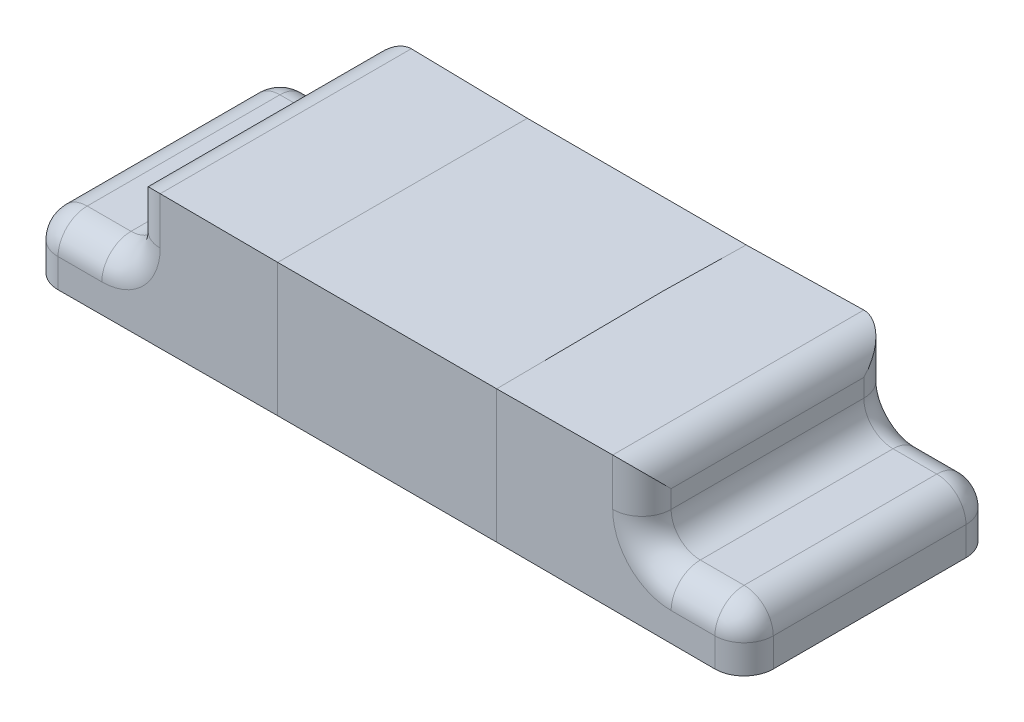
ISO-10303-21;
HEADER;
FILE_DESCRIPTION(('STEP AP214'),'2;1');
FILE_NAME('part.step','',(''),(''),'','','');
FILE_SCHEMA(('AUTOMOTIVE_DESIGN { 1 0 10303 214 1 1 1 1 }'));
ENDSEC;
DATA;
#1=APPLICATION_CONTEXT('core data for automotive mechanical design processes');
#2=APPLICATION_PROTOCOL_DEFINITION('international standard','automotive_design',2000,#1);
#3=PRODUCT_CONTEXT('',#1,'mechanical');
#4=PRODUCT('Part','Part','',(#3));
#5=PRODUCT_RELATED_PRODUCT_CATEGORY('part','',(#4));
#6=PRODUCT_DEFINITION_FORMATION('','',#4);
#7=PRODUCT_DEFINITION_CONTEXT('part definition',#1,'design');
#8=PRODUCT_DEFINITION('design','',#6,#7);
#9=PRODUCT_DEFINITION_SHAPE('','',#8);
#10=(LENGTH_UNIT() NAMED_UNIT(*) SI_UNIT(.MILLI.,.METRE.));
#11=(NAMED_UNIT(*) PLANE_ANGLE_UNIT() SI_UNIT($,.RADIAN.));
#12=(NAMED_UNIT(*) SI_UNIT($,.STERADIAN.) SOLID_ANGLE_UNIT());
#13=UNCERTAINTY_MEASURE_WITH_UNIT(LENGTH_MEASURE(1.E-05),#10,'distance_accuracy_value','');
#14=(GEOMETRIC_REPRESENTATION_CONTEXT(3) GLOBAL_UNCERTAINTY_ASSIGNED_CONTEXT((#13)) GLOBAL_UNIT_ASSIGNED_CONTEXT((#10,
#11,#12)) REPRESENTATION_CONTEXT('',''));
#15=CARTESIAN_POINT('',(0.,0.,0.));
#16=DIRECTION('',(0.,0.,1.));
#17=DIRECTION('',(1.,0.,0.));
#18=AXIS2_PLACEMENT_3D('',#15,#16,#17);
#19=CARTESIAN_POINT('',(0.875,0.,0.));
#20=DIRECTION('',(-1.,0.,0.));
#21=DIRECTION('',(0.,0.,1.));
#22=AXIS2_PLACEMENT_3D('',#19,#20,#21);
#23=PLANE('',#22);
#24=DIRECTION('',(0.,1.,0.));
#25=VECTOR('',#24,1.);
#26=CARTESIAN_POINT('',(0.875,0.,-0.33));
#27=LINE('',#26,#25);
#28=CARTESIAN_POINT('',(0.875,0.298442990090282,-0.33));
#29=VERTEX_POINT('',#28);
#30=CARTESIAN_POINT('',(0.875,0.36,-0.33));
#31=VERTEX_POINT('',#30);
#32=EDGE_CURVE('E511',#29,#31,#27,.T.);
#33=ORIENTED_EDGE('',*,*,#32,.T.);
#34=DIRECTION('',(0.,0.,1.));
#35=VECTOR('',#34,1.);
#36=CARTESIAN_POINT('',(0.875,0.36,0.));
#37=LINE('',#36,#35);
#38=CARTESIAN_POINT('',(0.875,0.36,0.33));
#39=VERTEX_POINT('',#38);
#40=EDGE_CURVE('E486',#31,#39,#37,.T.);
#41=ORIENTED_EDGE('',*,*,#40,.T.);
#42=DIRECTION('',(0.,-1.,0.));
#43=VECTOR('',#42,1.);
#44=CARTESIAN_POINT('',(0.875,0.,0.33));
#45=LINE('',#44,#43);
#46=CARTESIAN_POINT('',(0.875,0.298442990090282,0.33));
#47=VERTEX_POINT('',#46);
#48=EDGE_CURVE('E514',#39,#47,#45,.T.);
#49=ORIENTED_EDGE('',*,*,#48,.T.);
#50=DIRECTION('',(0.,0.,1.));
#51=VECTOR('',#50,1.);
#52=CARTESIAN_POINT('',(0.875,0.298442990090282,-0.43));
#53=LINE('',#52,#51);
#54=EDGE_CURVE('E276',#47,#29,#53,.F.);
#55=ORIENTED_EDGE('',*,*,#54,.T.);
#56=EDGE_LOOP('',(#33,#41,#49,#55));
#57=FACE_BOUND('',#56,.T.);
#58=ADVANCED_FACE('F43',(#57),#23,.F.);
#59=CARTESIAN_POINT('',(0.375,0.,-0.425));
#60=DIRECTION('',(0.,0.,1.));
#61=DIRECTION('',(1.,0.,0.));
#62=AXIS2_PLACEMENT_3D('',#59,#60,#61);
#63=PLANE('',#62);
#64=CARTESIAN_POINT('',(-0.375,0.,-0.425));
#65=DIRECTION('',(0.,1.,0.));
#66=VECTOR('',#65,1.);
#67=LINE('',#64,#66);
#68=CARTESIAN_POINT('',(-0.375,0.,-0.4275));
#69=VERTEX_POINT('',#68);
#70=CARTESIAN_POINT('',(-0.375,0.455,-0.4275));
#71=VERTEX_POINT('',#70);
#72=EDGE_CURVE('E236',#69,#71,#67,.T.);
#73=ORIENTED_EDGE('',*,*,#72,.T.);
#74=DIRECTION('',(-1.,0.,0.));
#75=VECTOR('',#74,1.);
#76=CARTESIAN_POINT('',(0.375,0.45,-0.425));
#77=LINE('',#76,#75);
#78=CARTESIAN_POINT('',(0.375,0.454472135955,-0.4272360679775));
#79=VERTEX_POINT('',#78);
#80=EDGE_CURVE('E273',#79,#71,#77,.T.);
#81=ORIENTED_EDGE('',*,*,#80,.F.);
#82=CARTESIAN_POINT('',(0.375,0.,-0.43));
#83=DIRECTION('',(0.,1.,0.));
#84=VECTOR('',#83,1.);
#85=LINE('',#82,#84);
#86=CARTESIAN_POINT('',(0.375,0.,-0.4275));
#87=VERTEX_POINT('',#86);
#88=EDGE_CURVE('E252',#87,#79,#85,.T.);
#89=ORIENTED_EDGE('',*,*,#88,.F.);
#90=DIRECTION('',(-1.,0.,0.));
#91=VECTOR('',#90,1.);
#92=CARTESIAN_POINT('',(0.375,0.,-0.425));
#93=LINE('',#92,#91);
#94=EDGE_CURVE('E225',#87,#69,#93,.T.);
#95=ORIENTED_EDGE('',*,*,#94,.T.);
#96=EDGE_LOOP('',(#73,#81,#89,#95));
#97=FACE_BOUND('',#96,.T.);
#98=ADVANCED_FACE('F250',(#97),#63,.F.);
#99=CARTESIAN_POINT('',(0.375,0.45,0.425));
#100=DIRECTION('',(0.,-1.,0.));
#101=DIRECTION('',(0.,0.,-1.));
#102=AXIS2_PLACEMENT_3D('',#99,#100,#101);
#103=PLANE('',#102);
#104=CARTESIAN_POINT('',(-0.375,0.45,-0.425));
#105=DIRECTION('',(0.,0.,1.));
#106=VECTOR('',#105,1.);
#107=LINE('',#104,#106);
#108=CARTESIAN_POINT('',(-0.375,0.455,0.4275));
#109=VERTEX_POINT('',#108);
#110=EDGE_CURVE('E246',#71,#109,#107,.T.);
#111=ORIENTED_EDGE('',*,*,#110,.T.);
#112=DIRECTION('',(-1.,0.,0.));
#113=VECTOR('',#112,1.);
#114=CARTESIAN_POINT('',(0.375,0.45,0.425));
#115=LINE('',#114,#113);
#116=CARTESIAN_POINT('',(0.375,0.455,0.4275));
#117=VERTEX_POINT('',#116);
#118=EDGE_CURVE('E258',#117,#109,#115,.T.);
#119=ORIENTED_EDGE('',*,*,#118,.F.);
#120=DIRECTION('',(0.,0.,1.));
#121=VECTOR('',#120,1.);
#122=CARTESIAN_POINT('',(0.375,0.45,0.425));
#123=LINE('',#122,#121);
#124=EDGE_CURVE('E261',#79,#117,#123,.T.);
#125=ORIENTED_EDGE('',*,*,#124,.F.);
#126=ORIENTED_EDGE('',*,*,#80,.T.);
#127=EDGE_LOOP('',(#111,#119,#125,#126));
#128=FACE_BOUND('',#127,.T.);
#129=ADVANCED_FACE('F300',(#128),#103,.F.);
#130=CARTESIAN_POINT('',(0.375,0.,0.425));
#131=DIRECTION('',(0.,0.,-1.));
#132=DIRECTION('',(-1.,0.,0.));
#133=AXIS2_PLACEMENT_3D('',#130,#131,#132);
#134=PLANE('',#133);
#135=CARTESIAN_POINT('',(-0.375,0.45,0.425));
#136=DIRECTION('',(0.,-1.,0.));
#137=VECTOR('',#136,1.);
#138=LINE('',#135,#137);
#139=CARTESIAN_POINT('',(-0.375,0.,0.4275));
#140=VERTEX_POINT('',#139);
#141=EDGE_CURVE('E341',#109,#140,#138,.T.);
#142=ORIENTED_EDGE('',*,*,#141,.T.);
#143=DIRECTION('',(-1.,0.,0.));
#144=VECTOR('',#143,1.);
#145=CARTESIAN_POINT('',(0.375,0.,0.425));
#146=LINE('',#145,#144);
#147=CARTESIAN_POINT('',(0.375,0.,0.4275));
#148=VERTEX_POINT('',#147);
#149=EDGE_CURVE('E254',#148,#140,#146,.T.);
#150=ORIENTED_EDGE('',*,*,#149,.F.);
#151=CARTESIAN_POINT('',(0.375,0.46,0.43));
#152=DIRECTION('',(0.,-1.,0.));
#153=VECTOR('',#152,1.);
#154=LINE('',#151,#153);
#155=EDGE_CURVE('E255',#117,#148,#154,.T.);
#156=ORIENTED_EDGE('',*,*,#155,.F.);
#157=ORIENTED_EDGE('',*,*,#118,.T.);
#158=EDGE_LOOP('',(#142,#150,#156,#157));
#159=FACE_BOUND('',#158,.T.);
#160=ADVANCED_FACE('F290',(#159),#134,.F.);
#161=CARTESIAN_POINT('',(0.375,0.,0.425));
#162=DIRECTION('',(0.,1.,0.));
#163=DIRECTION('',(0.,0.,1.));
#164=AXIS2_PLACEMENT_3D('',#161,#162,#163);
#165=PLANE('',#164);
#166=DIRECTION('',(0.,0.,-1.));
#167=VECTOR('',#166,1.);
#168=CARTESIAN_POINT('',(-1.225,0.,0.43));
#169=LINE('',#168,#167);
#170=CARTESIAN_POINT('',(-1.225,0.,0.33));
#171=VERTEX_POINT('',#170);
#172=CARTESIAN_POINT('',(-1.225,0.,-0.33));
#173=VERTEX_POINT('',#172);
#174=EDGE_CURVE('E330',#171,#173,#169,.T.);
#175=ORIENTED_EDGE('',*,*,#174,.T.);
#176=CARTESIAN_POINT('',(-1.125,0.,-0.33));
#177=DIRECTION('',(0.,1.,0.));
#178=DIRECTION('',(0.,0.,1.));
#179=AXIS2_PLACEMENT_3D('',#176,#177,#178);
#180=CIRCLE('',#179,0.1);
#181=CARTESIAN_POINT('',(-1.125,0.,-0.43));
#182=VERTEX_POINT('',#181);
#183=EDGE_CURVE('E228',#173,#182,#180,.F.);
#184=ORIENTED_EDGE('',*,*,#183,.T.);
#185=DIRECTION('',(1.,0.,0.));
#186=VECTOR('',#185,1.);
#187=CARTESIAN_POINT('',(-0.875,0.,-0.43));
#188=LINE('',#187,#186);
#189=EDGE_CURVE('E219',#182,#69,#188,.T.);
#190=ORIENTED_EDGE('',*,*,#189,.T.);
#191=ORIENTED_EDGE('',*,*,#94,.F.);
#192=DIRECTION('',(-1.,0.,0.));
#193=VECTOR('',#192,1.);
#194=CARTESIAN_POINT('',(0.875,0.,-0.43));
#195=LINE('',#194,#193);
#196=CARTESIAN_POINT('',(1.125,0.,-0.43));
#197=VERTEX_POINT('',#196);
#198=EDGE_CURVE('E468',#197,#87,#195,.T.);
#199=ORIENTED_EDGE('',*,*,#198,.F.);
#200=CARTESIAN_POINT('',(1.125,0.,-0.33));
#201=DIRECTION('',(0.,1.,0.));
#202=DIRECTION('',(0.,0.,1.));
#203=AXIS2_PLACEMENT_3D('',#200,#201,#202);
#204=CIRCLE('',#203,0.1);
#205=CARTESIAN_POINT('',(1.225,0.,-0.33));
#206=VERTEX_POINT('',#205);
#207=EDGE_CURVE('E666',#197,#206,#204,.F.);
#208=ORIENTED_EDGE('',*,*,#207,.T.);
#209=DIRECTION('',(0.,0.,-1.));
#210=VECTOR('',#209,1.);
#211=CARTESIAN_POINT('',(1.225,0.,0.43));
#212=LINE('',#211,#210);
#213=CARTESIAN_POINT('',(1.225,0.,0.33));
#214=VERTEX_POINT('',#213);
#215=EDGE_CURVE('E461',#214,#206,#212,.T.);
#216=ORIENTED_EDGE('',*,*,#215,.F.);
#217=CARTESIAN_POINT('',(1.125,0.,0.33));
#218=DIRECTION('',(0.,1.,0.));
#219=DIRECTION('',(0.,0.,1.));
#220=AXIS2_PLACEMENT_3D('',#217,#218,#219);
#221=CIRCLE('',#220,0.1);
#222=CARTESIAN_POINT('',(1.125,0.,0.43));
#223=VERTEX_POINT('',#222);
#224=EDGE_CURVE('E662',#214,#223,#221,.F.);
#225=ORIENTED_EDGE('',*,*,#224,.T.);
#226=DIRECTION('',(-1.,0.,0.));
#227=VECTOR('',#226,1.);
#228=CARTESIAN_POINT('',(0.875,0.,0.43));
#229=LINE('',#228,#227);
#230=EDGE_CURVE('E412',#223,#148,#229,.T.);
#231=ORIENTED_EDGE('',*,*,#230,.T.);
#232=ORIENTED_EDGE('',*,*,#149,.T.);
#233=DIRECTION('',(1.,0.,0.));
#234=VECTOR('',#233,1.);
#235=CARTESIAN_POINT('',(-0.875,0.,0.43));
#236=LINE('',#235,#234);
#237=CARTESIAN_POINT('',(-1.125,0.,0.43));
#238=VERTEX_POINT('',#237);
#239=EDGE_CURVE('E233',#238,#140,#236,.T.);
#240=ORIENTED_EDGE('',*,*,#239,.F.);
#241=CARTESIAN_POINT('',(-1.125,0.,0.33));
#242=DIRECTION('',(0.,1.,0.));
#243=DIRECTION('',(0.,0.,1.));
#244=AXIS2_PLACEMENT_3D('',#241,#242,#243);
#245=CIRCLE('',#244,0.1);
#246=EDGE_CURVE('E66',#238,#171,#245,.F.);
#247=ORIENTED_EDGE('',*,*,#246,.T.);
#248=EDGE_LOOP('',(#175,#184,#190,#191,#199,#208,#216,#225,#231,#232,#240,#247));
#249=FACE_BOUND('',#248,.T.);
#250=ADVANCED_FACE('F222',(#249),#165,.F.);
#251=CARTESIAN_POINT('',(0.875,0.,-0.43));
#252=DIRECTION('',(0.,0.,1.));
#253=DIRECTION('',(1.,0.,0.));
#254=AXIS2_PLACEMENT_3D('',#251,#252,#253);
#255=PLANE('',#254);
#256=DIRECTION('',(-1.,0.,0.));
#257=VECTOR('',#256,1.);
#258=CARTESIAN_POINT('',(0.875,0.098442990090282,-0.43));
#259=LINE('',#258,#257);
#260=CARTESIAN_POINT('',(0.975,0.098442990090282,-0.43));
#261=VERTEX_POINT('',#260);
#262=CARTESIAN_POINT('',(1.125,0.098442990090282,-0.43));
#263=VERTEX_POINT('',#262);
#264=EDGE_CURVE('E488',#261,#263,#259,.F.);
#265=ORIENTED_EDGE('',*,*,#264,.T.);
#266=DIRECTION('',(0.,1.,0.));
#267=VECTOR('',#266,1.);
#268=CARTESIAN_POINT('',(1.125,0.,-0.43));
#269=LINE('',#268,#267);
#270=EDGE_CURVE('E467',#263,#197,#269,.F.);
#271=ORIENTED_EDGE('',*,*,#270,.T.);
#272=ORIENTED_EDGE('',*,*,#198,.T.);
#273=ORIENTED_EDGE('',*,*,#88,.T.);
#274=DIRECTION('',(-1.,0.,0.));
#275=VECTOR('',#274,1.);
#276=CARTESIAN_POINT('',(0.875,0.46,-0.43));
#277=LINE('',#276,#275);
#278=CARTESIAN_POINT('',(0.775,0.46,-0.43));
#279=VERTEX_POINT('',#278);
#280=EDGE_CURVE('E247',#279,#79,#277,.T.);
#281=ORIENTED_EDGE('',*,*,#280,.F.);
#282=DIRECTION('',(0.,1.,0.));
#283=VECTOR('',#282,1.);
#284=CARTESIAN_POINT('',(0.775,0.,-0.43));
#285=LINE('',#284,#283);
#286=CARTESIAN_POINT('',(0.775,0.298442990090282,-0.43));
#287=VERTEX_POINT('',#286);
#288=EDGE_CURVE('E413',#279,#287,#285,.F.);
#289=ORIENTED_EDGE('',*,*,#288,.T.);
#290=CARTESIAN_POINT('',(0.975,0.298442990090282,-0.43));
#291=DIRECTION('',(0.,0.,1.));
#292=DIRECTION('',(1.,0.,0.));
#293=AXIS2_PLACEMENT_3D('',#290,#291,#292);
#294=CIRCLE('',#293,0.2);
#295=EDGE_CURVE('E490',#261,#287,#294,.F.);
#296=ORIENTED_EDGE('',*,*,#295,.F.);
#297=EDGE_LOOP('',(#265,#271,#272,#273,#281,#289,#296));
#298=FACE_BOUND('',#297,.T.);
#299=ADVANCED_FACE('F498',(#298),#255,.F.);
#300=CARTESIAN_POINT('',(0.875,0.46,0.43));
#301=DIRECTION('',(0.,-1.,0.));
#302=DIRECTION('',(0.,0.,-1.));
#303=AXIS2_PLACEMENT_3D('',#300,#301,#302);
#304=PLANE('',#303);
#305=DIRECTION('',(-1.,0.,0.));
#306=VECTOR('',#305,1.);
#307=CARTESIAN_POINT('',(0.875,0.46,0.43));
#308=LINE('',#307,#306);
#309=CARTESIAN_POINT('',(0.775,0.46,0.43));
#310=VERTEX_POINT('',#309);
#311=EDGE_CURVE('E409',#310,#117,#308,.T.);
#312=ORIENTED_EDGE('',*,*,#311,.F.);
#313=DIRECTION('',(0.,0.,1.));
#314=VECTOR('',#313,1.);
#315=CARTESIAN_POINT('',(0.775,0.46,0.43));
#316=LINE('',#315,#314);
#317=EDGE_CURVE('E422',#310,#279,#316,.F.);
#318=ORIENTED_EDGE('',*,*,#317,.T.);
#319=ORIENTED_EDGE('',*,*,#280,.T.);
#320=DIRECTION('',(0.,0.,1.));
#321=VECTOR('',#320,1.);
#322=CARTESIAN_POINT('',(0.375,0.46,0.43));
#323=LINE('',#322,#321);
#324=EDGE_CURVE('E471',#79,#117,#323,.T.);
#325=ORIENTED_EDGE('',*,*,#324,.T.);
#326=EDGE_LOOP('',(#312,#318,#319,#325));
#327=FACE_BOUND('',#326,.T.);
#328=ADVANCED_FACE('F392',(#327),#304,.F.);
#329=CARTESIAN_POINT('',(0.875,0.,0.43));
#330=DIRECTION('',(0.,0.,-1.));
#331=DIRECTION('',(-1.,0.,0.));
#332=AXIS2_PLACEMENT_3D('',#329,#330,#331);
#333=PLANE('',#332);
#334=ORIENTED_EDGE('',*,*,#230,.F.);
#335=DIRECTION('',(0.,-1.,0.));
#336=VECTOR('',#335,1.);
#337=CARTESIAN_POINT('',(1.125,0.,0.43));
#338=LINE('',#337,#336);
#339=CARTESIAN_POINT('',(1.125,0.098442990090282,0.43));
#340=VERTEX_POINT('',#339);
#341=EDGE_CURVE('E668',#223,#340,#338,.F.);
#342=ORIENTED_EDGE('',*,*,#341,.T.);
#343=DIRECTION('',(-1.,0.,0.));
#344=VECTOR('',#343,1.);
#345=CARTESIAN_POINT('',(0.875,0.098442990090282,0.43));
#346=LINE('',#345,#344);
#347=CARTESIAN_POINT('',(0.975,0.098442990090282,0.43));
#348=VERTEX_POINT('',#347);
#349=EDGE_CURVE('E418',#340,#348,#346,.T.);
#350=ORIENTED_EDGE('',*,*,#349,.T.);
#351=CARTESIAN_POINT('',(0.975,0.298442990090282,0.43));
#352=DIRECTION('',(0.,0.,-1.));
#353=DIRECTION('',(-1.,0.,0.));
#354=AXIS2_PLACEMENT_3D('',#351,#352,#353);
#355=CIRCLE('',#354,0.2);
#356=CARTESIAN_POINT('',(0.775,0.298442990090282,0.43));
#357=VERTEX_POINT('',#356);
#358=EDGE_CURVE('E415',#357,#348,#355,.F.);
#359=ORIENTED_EDGE('',*,*,#358,.F.);
#360=DIRECTION('',(0.,-1.,0.));
#361=VECTOR('',#360,1.);
#362=CARTESIAN_POINT('',(0.775,0.,0.43));
#363=LINE('',#362,#361);
#364=EDGE_CURVE('E420',#357,#310,#363,.F.);
#365=ORIENTED_EDGE('',*,*,#364,.T.);
#366=ORIENTED_EDGE('',*,*,#311,.T.);
#367=ORIENTED_EDGE('',*,*,#155,.T.);
#368=EDGE_LOOP('',(#334,#342,#350,#359,#365,#366,#367));
#369=FACE_BOUND('',#368,.T.);
#370=ADVANCED_FACE('F387',(#369),#333,.F.);
#371=CARTESIAN_POINT('',(0.375,0.,0.));
#372=DIRECTION('',(-1.,0.,0.));
#373=DIRECTION('',(0.,0.,1.));
#374=AXIS2_PLACEMENT_3D('',#371,#372,#373);
#375=PLANE('',#374);
#376=ORIENTED_EDGE('',*,*,#324,.F.);
#377=ORIENTED_EDGE('',*,*,#124,.T.);
#378=EDGE_LOOP('',(#376,#377));
#379=FACE_BOUND('',#378,.T.);
#380=ADVANCED_FACE('F380',(#379),#375,.T.);
#381=CARTESIAN_POINT('',(1.225,0.198442990090282,0.43));
#382=DIRECTION('',(0.,-1.,0.));
#383=DIRECTION('',(0.,0.,-1.));
#384=AXIS2_PLACEMENT_3D('',#381,#382,#383);
#385=PLANE('',#384);
#386=DIRECTION('',(-1.,0.,0.));
#387=VECTOR('',#386,1.);
#388=CARTESIAN_POINT('',(1.225,0.198442990090282,-0.33));
#389=LINE('',#388,#387);
#390=CARTESIAN_POINT('',(1.125,0.198442990090282,-0.33));
#391=VERTEX_POINT('',#390);
#392=CARTESIAN_POINT('',(0.975,0.198442990090282,-0.33));
#393=VERTEX_POINT('',#392);
#394=EDGE_CURVE('E430',#391,#393,#389,.T.);
#395=ORIENTED_EDGE('',*,*,#394,.T.);
#396=DIRECTION('',(0.,0.,1.));
#397=VECTOR('',#396,1.);
#398=CARTESIAN_POINT('',(0.975,0.198442990090282,0.43));
#399=LINE('',#398,#397);
#400=CARTESIAN_POINT('',(0.975,0.198442990090282,0.33));
#401=VERTEX_POINT('',#400);
#402=EDGE_CURVE('E433',#393,#401,#399,.T.);
#403=ORIENTED_EDGE('',*,*,#402,.T.);
#404=DIRECTION('',(-1.,0.,0.));
#405=VECTOR('',#404,1.);
#406=CARTESIAN_POINT('',(1.225,0.198442990090282,0.33));
#407=LINE('',#406,#405);
#408=CARTESIAN_POINT('',(1.125,0.198442990090282,0.33));
#409=VERTEX_POINT('',#408);
#410=EDGE_CURVE('E427',#401,#409,#407,.F.);
#411=ORIENTED_EDGE('',*,*,#410,.T.);
#412=DIRECTION('',(0.,0.,1.));
#413=VECTOR('',#412,1.);
#414=CARTESIAN_POINT('',(1.125,0.198442990090282,0.43));
#415=LINE('',#414,#413);
#416=EDGE_CURVE('E424',#409,#391,#415,.F.);
#417=ORIENTED_EDGE('',*,*,#416,.T.);
#418=EDGE_LOOP('',(#395,#403,#411,#417));
#419=FACE_BOUND('',#418,.T.);
#420=ADVANCED_FACE('F376',(#419),#385,.F.);
#421=CARTESIAN_POINT('',(1.225,0.,0.));
#422=DIRECTION('',(-1.,0.,0.));
#423=DIRECTION('',(0.,0.,1.));
#424=AXIS2_PLACEMENT_3D('',#421,#422,#423);
#425=PLANE('',#424);
#426=ORIENTED_EDGE('',*,*,#215,.T.);
#427=DIRECTION('',(0.,1.,0.));
#428=VECTOR('',#427,1.);
#429=CARTESIAN_POINT('',(1.225,0.,-0.33));
#430=LINE('',#429,#428);
#431=CARTESIAN_POINT('',(1.225,0.098442990090282,-0.33));
#432=VERTEX_POINT('',#431);
#433=EDGE_CURVE('E464',#206,#432,#430,.T.);
#434=ORIENTED_EDGE('',*,*,#433,.T.);
#435=DIRECTION('',(0.,0.,1.));
#436=VECTOR('',#435,1.);
#437=CARTESIAN_POINT('',(1.225,0.098442990090282,0.));
#438=LINE('',#437,#436);
#439=CARTESIAN_POINT('',(1.225,0.098442990090282,0.33));
#440=VERTEX_POINT('',#439);
#441=EDGE_CURVE('E435',#432,#440,#438,.T.);
#442=ORIENTED_EDGE('',*,*,#441,.T.);
#443=DIRECTION('',(0.,-1.,0.));
#444=VECTOR('',#443,1.);
#445=CARTESIAN_POINT('',(1.225,0.,0.33));
#446=LINE('',#445,#444);
#447=EDGE_CURVE('E438',#440,#214,#446,.T.);
#448=ORIENTED_EDGE('',*,*,#447,.T.);
#449=EDGE_LOOP('',(#426,#434,#442,#448));
#450=FACE_BOUND('',#449,.T.);
#451=ADVANCED_FACE('F365',(#450),#425,.F.);
#452=CARTESIAN_POINT('',(0.875,0.098442990090282,0.33));
#453=DIRECTION('',(-1.,0.,0.));
#454=DIRECTION('',(0.,0.,1.));
#455=AXIS2_PLACEMENT_3D('',#452,#453,#454);
#456=CYLINDRICAL_SURFACE('',#455,0.1);
#457=ORIENTED_EDGE('',*,*,#349,.F.);
#458=CARTESIAN_POINT('',(1.125,0.098442990090282,0.33));
#459=DIRECTION('',(-1.,0.,0.));
#460=DIRECTION('',(0.,0.,1.));
#461=AXIS2_PLACEMENT_3D('',#458,#459,#460);
#462=CIRCLE('',#461,0.1);
#463=EDGE_CURVE('E676',#340,#409,#462,.T.);
#464=ORIENTED_EDGE('',*,*,#463,.T.);
#465=ORIENTED_EDGE('',*,*,#410,.F.);
#466=CARTESIAN_POINT('',(0.975,0.098442990090282,0.33));
#467=DIRECTION('',(-1.,0.,0.));
#468=DIRECTION('',(0.,0.,1.));
#469=AXIS2_PLACEMENT_3D('',#466,#467,#468);
#470=CIRCLE('',#469,0.1);
#471=EDGE_CURVE('E458',#348,#401,#470,.T.);
#472=ORIENTED_EDGE('',*,*,#471,.F.);
#473=EDGE_LOOP('',(#457,#464,#465,#472));
#474=FACE_BOUND('',#473,.T.);
#475=ADVANCED_FACE('F375',(#474),#456,.T.);
#476=CARTESIAN_POINT('',(1.125,0.098442990090282,0.));
#477=DIRECTION('',(0.,0.,1.));
#478=DIRECTION('',(1.,0.,0.));
#479=AXIS2_PLACEMENT_3D('',#476,#477,#478);
#480=CYLINDRICAL_SURFACE('',#479,0.1);
#481=ORIENTED_EDGE('',*,*,#441,.F.);
#482=CARTESIAN_POINT('',(1.125,0.098442990090282,-0.33));
#483=DIRECTION('',(0.,0.,1.));
#484=DIRECTION('',(1.,0.,0.));
#485=AXIS2_PLACEMENT_3D('',#482,#483,#484);
#486=CIRCLE('',#485,0.1);
#487=EDGE_CURVE('E674',#432,#391,#486,.T.);
#488=ORIENTED_EDGE('',*,*,#487,.T.);
#489=ORIENTED_EDGE('',*,*,#416,.F.);
#490=CARTESIAN_POINT('',(1.125,0.098442990090282,0.33));
#491=DIRECTION('',(0.,0.,1.));
#492=DIRECTION('',(1.,0.,0.));
#493=AXIS2_PLACEMENT_3D('',#490,#491,#492);
#494=CIRCLE('',#493,0.1);
#495=EDGE_CURVE('E672',#409,#440,#494,.F.);
#496=ORIENTED_EDGE('',*,*,#495,.T.);
#497=EDGE_LOOP('',(#481,#488,#489,#496));
#498=FACE_BOUND('',#497,.T.);
#499=ADVANCED_FACE('F551',(#498),#480,.T.);
#500=CARTESIAN_POINT('',(0.975,0.298442990090282,0.33));
#501=DIRECTION('',(0.,0.,-1.));
#502=DIRECTION('',(-1.,0.,0.));
#503=AXIS2_PLACEMENT_3D('',#500,#501,#502);
#504=TOROIDAL_SURFACE('',#503,0.2,0.1);
#505=ORIENTED_EDGE('',*,*,#358,.T.);
#506=ORIENTED_EDGE('',*,*,#471,.T.);
#507=CARTESIAN_POINT('',(0.975,0.298442990090282,0.33));
#508=DIRECTION('',(0.,0.,-1.));
#509=DIRECTION('',(-1.,0.,0.));
#510=AXIS2_PLACEMENT_3D('',#507,#508,#509);
#511=CIRCLE('',#510,0.1);
#512=EDGE_CURVE('E455',#47,#401,#511,.F.);
#513=ORIENTED_EDGE('',*,*,#512,.F.);
#514=CARTESIAN_POINT('',(0.775,0.298442990090282,0.33));
#515=DIRECTION('',(0.,-1.,0.));
#516=DIRECTION('',(0.,0.,-1.));
#517=AXIS2_PLACEMENT_3D('',#514,#515,#516);
#518=CIRCLE('',#517,0.1);
#519=EDGE_CURVE('E452',#357,#47,#518,.F.);
#520=ORIENTED_EDGE('',*,*,#519,.F.);
#521=EDGE_LOOP('',(#505,#506,#513,#520));
#522=FACE_BOUND('',#521,.T.);
#523=ADVANCED_FACE('F526',(#522),#504,.T.);
#524=CARTESIAN_POINT('',(1.225,0.098442990090282,-0.33));
#525=DIRECTION('',(-1.,0.,0.));
#526=DIRECTION('',(0.,0.,1.));
#527=AXIS2_PLACEMENT_3D('',#524,#525,#526);
#528=CYLINDRICAL_SURFACE('',#527,0.1);
#529=ORIENTED_EDGE('',*,*,#394,.F.);
#530=CARTESIAN_POINT('',(1.125,0.098442990090282,-0.33));
#531=DIRECTION('',(-1.,0.,0.));
#532=DIRECTION('',(0.,0.,1.));
#533=AXIS2_PLACEMENT_3D('',#530,#531,#532);
#534=CIRCLE('',#533,0.1);
#535=EDGE_CURVE('E670',#391,#263,#534,.T.);
#536=ORIENTED_EDGE('',*,*,#535,.T.);
#537=ORIENTED_EDGE('',*,*,#264,.F.);
#538=CARTESIAN_POINT('',(0.975,0.098442990090282,-0.33));
#539=DIRECTION('',(-1.,0.,0.));
#540=DIRECTION('',(0.,0.,1.));
#541=AXIS2_PLACEMENT_3D('',#538,#539,#540);
#542=CIRCLE('',#541,0.1);
#543=EDGE_CURVE('E449',#393,#261,#542,.T.);
#544=ORIENTED_EDGE('',*,*,#543,.F.);
#545=EDGE_LOOP('',(#529,#536,#537,#544));
#546=FACE_BOUND('',#545,.T.);
#547=ADVANCED_FACE('F545',(#546),#528,.T.);
#548=CARTESIAN_POINT('',(0.975,0.298442990090282,0.43));
#549=DIRECTION('',(0.,0.,-1.));
#550=DIRECTION('',(-1.,0.,0.));
#551=AXIS2_PLACEMENT_3D('',#548,#549,#550);
#552=CYLINDRICAL_SURFACE('',#551,0.1);
#553=ORIENTED_EDGE('',*,*,#512,.T.);
#554=ORIENTED_EDGE('',*,*,#402,.F.);
#555=CARTESIAN_POINT('',(0.975,0.298442990090282,-0.33));
#556=DIRECTION('',(0.,0.,1.));
#557=DIRECTION('',(1.,0.,0.));
#558=AXIS2_PLACEMENT_3D('',#555,#556,#557);
#559=CIRCLE('',#558,0.1);
#560=EDGE_CURVE('E447',#29,#393,#559,.T.);
#561=ORIENTED_EDGE('',*,*,#560,.F.);
#562=ORIENTED_EDGE('',*,*,#54,.F.);
#563=EDGE_LOOP('',(#553,#554,#561,#562));
#564=FACE_BOUND('',#563,.T.);
#565=ADVANCED_FACE('F530',(#564),#552,.F.);
#566=CARTESIAN_POINT('',(0.775,0.,0.33));
#567=DIRECTION('',(0.,-1.,0.));
#568=DIRECTION('',(0.,0.,-1.));
#569=AXIS2_PLACEMENT_3D('',#566,#567,#568);
#570=CYLINDRICAL_SURFACE('',#569,0.1);
#571=ORIENTED_EDGE('',*,*,#519,.T.);
#572=ORIENTED_EDGE('',*,*,#48,.F.);
#573=CARTESIAN_POINT('',(0.775,0.36,0.33));
#574=DIRECTION('',(0.,-0.707106781186547,0.707106781186547));
#575=DIRECTION('',(0.,0.707106781186547,0.707106781186547));
#576=AXIS2_PLACEMENT_3D('',#573,#574,#575);
#577=ELLIPSE('',#576,0.14142135623731,0.1);
#578=EDGE_CURVE('E444',#310,#39,#577,.F.);
#579=ORIENTED_EDGE('',*,*,#578,.F.);
#580=ORIENTED_EDGE('',*,*,#364,.F.);
#581=EDGE_LOOP('',(#571,#572,#579,#580));
#582=FACE_BOUND('',#581,.T.);
#583=ADVANCED_FACE('F524',(#582),#570,.T.);
#584=CARTESIAN_POINT('',(0.975,0.298442990090282,-0.33));
#585=DIRECTION('',(0.,0.,1.));
#586=DIRECTION('',(1.,0.,0.));
#587=AXIS2_PLACEMENT_3D('',#584,#585,#586);
#588=TOROIDAL_SURFACE('',#587,0.2,0.1);
#589=ORIENTED_EDGE('',*,*,#543,.T.);
#590=ORIENTED_EDGE('',*,*,#295,.T.);
#591=CARTESIAN_POINT('',(0.775,0.298442990090282,-0.33));
#592=DIRECTION('',(0.,-1.,0.));
#593=DIRECTION('',(0.,0.,-1.));
#594=AXIS2_PLACEMENT_3D('',#591,#592,#593);
#595=CIRCLE('',#594,0.1);
#596=EDGE_CURVE('E441',#29,#287,#595,.F.);
#597=ORIENTED_EDGE('',*,*,#596,.F.);
#598=ORIENTED_EDGE('',*,*,#560,.T.);
#599=EDGE_LOOP('',(#589,#590,#597,#598));
#600=FACE_BOUND('',#599,.T.);
#601=ADVANCED_FACE('F532',(#600),#588,.T.);
#602=CARTESIAN_POINT('',(0.775,0.36,0.));
#603=DIRECTION('',(0.,0.,1.));
#604=DIRECTION('',(1.,0.,0.));
#605=AXIS2_PLACEMENT_3D('',#602,#603,#604);
#606=CYLINDRICAL_SURFACE('',#605,0.1);
#607=ORIENTED_EDGE('',*,*,#578,.T.);
#608=ORIENTED_EDGE('',*,*,#40,.F.);
#609=CARTESIAN_POINT('',(0.775,0.36,-0.33));
#610=DIRECTION('',(0.,0.707106781186547,0.707106781186547));
#611=DIRECTION('',(0.,-0.707106781186547,0.707106781186547));
#612=AXIS2_PLACEMENT_3D('',#609,#610,#611);
#613=ELLIPSE('',#612,0.14142135623731,0.1);
#614=EDGE_CURVE('E439',#279,#31,#613,.F.);
#615=ORIENTED_EDGE('',*,*,#614,.F.);
#616=ORIENTED_EDGE('',*,*,#317,.F.);
#617=EDGE_LOOP('',(#607,#608,#615,#616));
#618=FACE_BOUND('',#617,.T.);
#619=ADVANCED_FACE('F507',(#618),#606,.T.);
#620=CARTESIAN_POINT('',(0.775,0.,-0.33));
#621=DIRECTION('',(0.,1.,0.));
#622=DIRECTION('',(0.,0.,1.));
#623=AXIS2_PLACEMENT_3D('',#620,#621,#622);
#624=CYLINDRICAL_SURFACE('',#623,0.1);
#625=ORIENTED_EDGE('',*,*,#596,.T.);
#626=ORIENTED_EDGE('',*,*,#288,.F.);
#627=ORIENTED_EDGE('',*,*,#614,.T.);
#628=ORIENTED_EDGE('',*,*,#32,.F.);
#629=EDGE_LOOP('',(#625,#626,#627,#628));
#630=FACE_BOUND('',#629,.T.);
#631=ADVANCED_FACE('F502',(#630),#624,.T.);
#632=CARTESIAN_POINT('',(1.125,0.098442990090282,-0.33));
#633=DIRECTION('',(0.,0.,1.));
#634=DIRECTION('',(1.,0.,0.));
#635=AXIS2_PLACEMENT_3D('',#632,#633,#634);
#636=SPHERICAL_SURFACE('',#635,0.1);
#637=ORIENTED_EDGE('',*,*,#535,.F.);
#638=ORIENTED_EDGE('',*,*,#487,.F.);
#639=CARTESIAN_POINT('',(1.125,0.098442990090282,-0.33));
#640=DIRECTION('',(0.,-1.,0.));
#641=DIRECTION('',(0.,0.,-1.));
#642=AXIS2_PLACEMENT_3D('',#639,#640,#641);
#643=CIRCLE('',#642,0.1);
#644=EDGE_CURVE('E442',#263,#432,#643,.T.);
#645=ORIENTED_EDGE('',*,*,#644,.F.);
#646=EDGE_LOOP('',(#637,#638,#645));
#647=FACE_BOUND('',#646,.T.);
#648=ADVANCED_FACE('F562',(#647),#636,.T.);
#649=CARTESIAN_POINT('',(1.125,0.,-0.33));
#650=DIRECTION('',(0.,1.,0.));
#651=DIRECTION('',(0.,0.,1.));
#652=AXIS2_PLACEMENT_3D('',#649,#650,#651);
#653=CYLINDRICAL_SURFACE('',#652,0.1);
#654=ORIENTED_EDGE('',*,*,#207,.F.);
#655=ORIENTED_EDGE('',*,*,#270,.F.);
#656=ORIENTED_EDGE('',*,*,#644,.T.);
#657=ORIENTED_EDGE('',*,*,#433,.F.);
#658=EDGE_LOOP('',(#654,#655,#656,#657));
#659=FACE_BOUND('',#658,.T.);
#660=ADVANCED_FACE('F558',(#659),#653,.T.);
#661=CARTESIAN_POINT('',(1.125,0.098442990090282,0.33));
#662=DIRECTION('',(0.,0.,1.));
#663=DIRECTION('',(1.,0.,0.));
#664=AXIS2_PLACEMENT_3D('',#661,#662,#663);
#665=SPHERICAL_SURFACE('',#664,0.1);
#666=ORIENTED_EDGE('',*,*,#495,.F.);
#667=ORIENTED_EDGE('',*,*,#463,.F.);
#668=CARTESIAN_POINT('',(1.125,0.098442990090282,0.33));
#669=DIRECTION('',(0.,-1.,0.));
#670=DIRECTION('',(0.,0.,-1.));
#671=AXIS2_PLACEMENT_3D('',#668,#669,#670);
#672=CIRCLE('',#671,0.1);
#673=EDGE_CURVE('E232',#440,#340,#672,.T.);
#674=ORIENTED_EDGE('',*,*,#673,.F.);
#675=EDGE_LOOP('',(#666,#667,#674));
#676=FACE_BOUND('',#675,.T.);
#677=ADVANCED_FACE('F561',(#676),#665,.T.);
#678=CARTESIAN_POINT('',(1.125,0.,0.33));
#679=DIRECTION('',(0.,-1.,0.));
#680=DIRECTION('',(0.,0.,-1.));
#681=AXIS2_PLACEMENT_3D('',#678,#679,#680);
#682=CYLINDRICAL_SURFACE('',#681,0.1);
#683=ORIENTED_EDGE('',*,*,#673,.T.);
#684=ORIENTED_EDGE('',*,*,#341,.F.);
#685=ORIENTED_EDGE('',*,*,#224,.F.);
#686=ORIENTED_EDGE('',*,*,#447,.F.);
#687=EDGE_LOOP('',(#683,#684,#685,#686));
#688=FACE_BOUND('',#687,.T.);
#689=ADVANCED_FACE('F364',(#688),#682,.T.);
#690=CARTESIAN_POINT('',(-0.875,0.,-0.43));
#691=DIRECTION('',(0.,0.,-1.));
#692=DIRECTION('',(-1.,0.,0.));
#693=AXIS2_PLACEMENT_3D('',#690,#691,#692);
#694=PLANE('',#693);
#695=ORIENTED_EDGE('',*,*,#189,.F.);
#696=DIRECTION('',(0.,1.,0.));
#697=VECTOR('',#696,1.);
#698=CARTESIAN_POINT('',(-1.125,0.098442990090282,-0.43));
#699=LINE('',#698,#697);
#700=CARTESIAN_POINT('',(-1.125,0.098442990090282,-0.43));
#701=VERTEX_POINT('',#700);
#702=EDGE_CURVE('E1068',#182,#701,#699,.T.);
#703=ORIENTED_EDGE('',*,*,#702,.T.);
#704=DIRECTION('',(1.,0.,0.));
#705=VECTOR('',#704,1.);
#706=CARTESIAN_POINT('',(-0.875,0.098442990090282,-0.43));
#707=LINE('',#706,#705);
#708=CARTESIAN_POINT('',(-0.975,0.098442990090282,-0.43));
#709=VERTEX_POINT('',#708);
#710=EDGE_CURVE('E1075',#701,#709,#707,.T.);
#711=ORIENTED_EDGE('',*,*,#710,.T.);
#712=CARTESIAN_POINT('',(-0.975,0.298442990090282,-0.43));
#713=DIRECTION('',(0.,0.,-1.));
#714=DIRECTION('',(-1.,0.,0.));
#715=AXIS2_PLACEMENT_3D('',#712,#713,#714);
#716=CIRCLE('',#715,0.2);
#717=CARTESIAN_POINT('',(-0.775,0.298442990090282,-0.43));
#718=VERTEX_POINT('',#717);
#719=EDGE_CURVE('E331',#718,#709,#716,.T.);
#720=ORIENTED_EDGE('',*,*,#719,.F.);
#721=DIRECTION('',(0.,1.,0.));
#722=VECTOR('',#721,1.);
#723=CARTESIAN_POINT('',(-0.775,0.46,-0.43));
#724=LINE('',#723,#722);
#725=CARTESIAN_POINT('',(-0.775,0.46,-0.43));
#726=VERTEX_POINT('',#725);
#727=EDGE_CURVE('E1081',#718,#726,#724,.T.);
#728=ORIENTED_EDGE('',*,*,#727,.T.);
#729=DIRECTION('',(1.,0.,0.));
#730=VECTOR('',#729,1.);
#731=CARTESIAN_POINT('',(-0.875,0.46,-0.43));
#732=LINE('',#731,#730);
#733=EDGE_CURVE('E241',#726,#71,#732,.T.);
#734=ORIENTED_EDGE('',*,*,#733,.T.);
#735=ORIENTED_EDGE('',*,*,#72,.F.);
#736=EDGE_LOOP('',(#695,#703,#711,#720,#728,#734,#735));
#737=FACE_BOUND('',#736,.T.);
#738=ADVANCED_FACE('F238',(#737),#694,.T.);
#739=CARTESIAN_POINT('',(-0.875,0.,0.43));
#740=DIRECTION('',(0.,0.,1.));
#741=DIRECTION('',(1.,0.,0.));
#742=AXIS2_PLACEMENT_3D('',#739,#740,#741);
#743=PLANE('',#742);
#744=DIRECTION('',(1.,0.,0.));
#745=VECTOR('',#744,1.);
#746=CARTESIAN_POINT('',(-0.875,0.098442990090282,0.43));
#747=LINE('',#746,#745);
#748=CARTESIAN_POINT('',(-0.975,0.098442990090282,0.43));
#749=VERTEX_POINT('',#748);
#750=CARTESIAN_POINT('',(-1.125,0.098442990090282,0.43));
#751=VERTEX_POINT('',#750);
#752=EDGE_CURVE('E1093',#749,#751,#747,.F.);
#753=ORIENTED_EDGE('',*,*,#752,.T.);
#754=DIRECTION('',(0.,-1.,0.));
#755=VECTOR('',#754,1.);
#756=CARTESIAN_POINT('',(-1.125,0.,0.43));
#757=LINE('',#756,#755);
#758=EDGE_CURVE('E625',#751,#238,#757,.T.);
#759=ORIENTED_EDGE('',*,*,#758,.T.);
#760=ORIENTED_EDGE('',*,*,#239,.T.);
#761=ORIENTED_EDGE('',*,*,#141,.F.);
#762=DIRECTION('',(1.,0.,0.));
#763=VECTOR('',#762,1.);
#764=CARTESIAN_POINT('',(-0.875,0.46,0.43));
#765=LINE('',#764,#763);
#766=CARTESIAN_POINT('',(-0.775,0.46,0.43));
#767=VERTEX_POINT('',#766);
#768=EDGE_CURVE('E329',#767,#109,#765,.T.);
#769=ORIENTED_EDGE('',*,*,#768,.F.);
#770=DIRECTION('',(0.,-1.,0.));
#771=VECTOR('',#770,1.);
#772=CARTESIAN_POINT('',(-0.775,0.198442990090282,0.43));
#773=LINE('',#772,#771);
#774=CARTESIAN_POINT('',(-0.775,0.298442990090282,0.43));
#775=VERTEX_POINT('',#774);
#776=EDGE_CURVE('E1099',#767,#775,#773,.T.);
#777=ORIENTED_EDGE('',*,*,#776,.T.);
#778=CARTESIAN_POINT('',(-0.975,0.298442990090282,0.43));
#779=DIRECTION('',(0.,0.,1.));
#780=DIRECTION('',(1.,0.,0.));
#781=AXIS2_PLACEMENT_3D('',#778,#779,#780);
#782=CIRCLE('',#781,0.2);
#783=EDGE_CURVE('E1096',#749,#775,#782,.T.);
#784=ORIENTED_EDGE('',*,*,#783,.F.);
#785=EDGE_LOOP('',(#753,#759,#760,#761,#769,#777,#784));
#786=FACE_BOUND('',#785,.T.);
#787=ADVANCED_FACE('F348',(#786),#743,.T.);
#788=CARTESIAN_POINT('',(-0.875,0.46,0.43));
#789=DIRECTION('',(0.,1.,0.));
#790=DIRECTION('',(0.,0.,1.));
#791=AXIS2_PLACEMENT_3D('',#788,#789,#790);
#792=PLANE('',#791);
#793=ORIENTED_EDGE('',*,*,#733,.F.);
#794=DIRECTION('',(0.,0.,1.));
#795=VECTOR('',#794,1.);
#796=CARTESIAN_POINT('',(-0.775,0.46,0.43));
#797=LINE('',#796,#795);
#798=EDGE_CURVE('E1101',#726,#767,#797,.T.);
#799=ORIENTED_EDGE('',*,*,#798,.T.);
#800=ORIENTED_EDGE('',*,*,#768,.T.);
#801=ORIENTED_EDGE('',*,*,#110,.F.);
#802=EDGE_LOOP('',(#793,#799,#800,#801));
#803=FACE_BOUND('',#802,.T.);
#804=ADVANCED_FACE('F358',(#803),#792,.T.);
#805=CARTESIAN_POINT('',(-0.875,0.,0.));
#806=DIRECTION('',(1.,0.,0.));
#807=DIRECTION('',(0.,0.,1.));
#808=AXIS2_PLACEMENT_3D('',#805,#806,#807);
#809=PLANE('',#808);
#810=DIRECTION('',(0.,-1.,0.));
#811=VECTOR('',#810,1.);
#812=CARTESIAN_POINT('',(-0.875,0.46,0.33));
#813=LINE('',#812,#811);
#814=CARTESIAN_POINT('',(-0.875,0.298442990090282,0.33));
#815=VERTEX_POINT('',#814);
#816=CARTESIAN_POINT('',(-0.875,0.36,0.33));
#817=VERTEX_POINT('',#816);
#818=EDGE_CURVE('E1086',#815,#817,#813,.F.);
#819=ORIENTED_EDGE('',*,*,#818,.T.);
#820=DIRECTION('',(0.,0.,1.));
#821=VECTOR('',#820,1.);
#822=CARTESIAN_POINT('',(-0.875,0.36,-0.43));
#823=LINE('',#822,#821);
#824=CARTESIAN_POINT('',(-0.875,0.36,-0.33));
#825=VERTEX_POINT('',#824);
#826=EDGE_CURVE('E1091',#817,#825,#823,.F.);
#827=ORIENTED_EDGE('',*,*,#826,.T.);
#828=DIRECTION('',(0.,1.,0.));
#829=VECTOR('',#828,1.);
#830=CARTESIAN_POINT('',(-0.875,0.198442990090282,-0.33));
#831=LINE('',#830,#829);
#832=CARTESIAN_POINT('',(-0.875,0.298442990090282,-0.33));
#833=VERTEX_POINT('',#832);
#834=EDGE_CURVE('E1088',#825,#833,#831,.F.);
#835=ORIENTED_EDGE('',*,*,#834,.T.);
#836=DIRECTION('',(0.,0.,1.));
#837=VECTOR('',#836,1.);
#838=CARTESIAN_POINT('',(-0.875,0.298442990090282,0.));
#839=LINE('',#838,#837);
#840=EDGE_CURVE('E1082',#833,#815,#839,.T.);
#841=ORIENTED_EDGE('',*,*,#840,.T.);
#842=EDGE_LOOP('',(#819,#827,#835,#841));
#843=FACE_BOUND('',#842,.T.);
#844=ADVANCED_FACE('F730',(#843),#809,.F.);
#845=CARTESIAN_POINT('',(-1.225,0.198442990090282,0.43));
#846=DIRECTION('',(0.,1.,0.));
#847=DIRECTION('',(0.,0.,1.));
#848=AXIS2_PLACEMENT_3D('',#845,#846,#847);
#849=PLANE('',#848);
#850=DIRECTION('',(1.,0.,0.));
#851=VECTOR('',#850,1.);
#852=CARTESIAN_POINT('',(-1.225,0.198442990090282,0.33));
#853=LINE('',#852,#851);
#854=CARTESIAN_POINT('',(-1.125,0.198442990090282,0.33));
#855=VERTEX_POINT('',#854);
#856=CARTESIAN_POINT('',(-0.975,0.198442990090282,0.33));
#857=VERTEX_POINT('',#856);
#858=EDGE_CURVE('E1106',#855,#857,#853,.T.);
#859=ORIENTED_EDGE('',*,*,#858,.T.);
#860=DIRECTION('',(0.,0.,1.));
#861=VECTOR('',#860,1.);
#862=CARTESIAN_POINT('',(-0.975,0.198442990090282,0.43));
#863=LINE('',#862,#861);
#864=CARTESIAN_POINT('',(-0.975,0.198442990090282,-0.33));
#865=VERTEX_POINT('',#864);
#866=EDGE_CURVE('E1069',#857,#865,#863,.F.);
#867=ORIENTED_EDGE('',*,*,#866,.T.);
#868=DIRECTION('',(1.,0.,0.));
#869=VECTOR('',#868,1.);
#870=CARTESIAN_POINT('',(-1.225,0.198442990090282,-0.33));
#871=LINE('',#870,#869);
#872=CARTESIAN_POINT('',(-1.125,0.198442990090282,-0.33));
#873=VERTEX_POINT('',#872);
#874=EDGE_CURVE('E1108',#865,#873,#871,.F.);
#875=ORIENTED_EDGE('',*,*,#874,.T.);
#876=DIRECTION('',(0.,0.,1.));
#877=VECTOR('',#876,1.);
#878=CARTESIAN_POINT('',(-1.125,0.198442990090282,0.43));
#879=LINE('',#878,#877);
#880=EDGE_CURVE('E1103',#873,#855,#879,.T.);
#881=ORIENTED_EDGE('',*,*,#880,.T.);
#882=EDGE_LOOP('',(#859,#867,#875,#881));
#883=FACE_BOUND('',#882,.T.);
#884=ADVANCED_FACE('F736',(#883),#849,.T.);
#885=CARTESIAN_POINT('',(-1.225,0.,0.));
#886=DIRECTION('',(1.,0.,0.));
#887=DIRECTION('',(0.,0.,1.));
#888=AXIS2_PLACEMENT_3D('',#885,#886,#887);
#889=PLANE('',#888);
#890=DIRECTION('',(0.,0.,1.));
#891=VECTOR('',#890,1.);
#892=CARTESIAN_POINT('',(-1.225,0.098442990090282,-0.43));
#893=LINE('',#892,#891);
#894=CARTESIAN_POINT('',(-1.225,0.098442990090282,0.33));
#895=VERTEX_POINT('',#894);
#896=CARTESIAN_POINT('',(-1.225,0.098442990090282,-0.33));
#897=VERTEX_POINT('',#896);
#898=EDGE_CURVE('E1066',#895,#897,#893,.F.);
#899=ORIENTED_EDGE('',*,*,#898,.T.);
#900=DIRECTION('',(0.,1.,0.));
#901=VECTOR('',#900,1.);
#902=CARTESIAN_POINT('',(-1.225,0.,-0.33));
#903=LINE('',#902,#901);
#904=EDGE_CURVE('E643',#897,#173,#903,.F.);
#905=ORIENTED_EDGE('',*,*,#904,.T.);
#906=ORIENTED_EDGE('',*,*,#174,.F.);
#907=DIRECTION('',(0.,-1.,0.));
#908=VECTOR('',#907,1.);
#909=CARTESIAN_POINT('',(-1.225,0.098442990090282,0.33));
#910=LINE('',#909,#908);
#911=EDGE_CURVE('E624',#171,#895,#910,.F.);
#912=ORIENTED_EDGE('',*,*,#911,.T.);
#913=EDGE_LOOP('',(#899,#905,#906,#912));
#914=FACE_BOUND('',#913,.T.);
#915=ADVANCED_FACE('F609',(#914),#889,.F.);
#916=CARTESIAN_POINT('',(-1.225,0.098442990090282,0.33));
#917=DIRECTION('',(1.,0.,0.));
#918=DIRECTION('',(0.,0.,-1.));
#919=AXIS2_PLACEMENT_3D('',#916,#917,#918);
#920=CYLINDRICAL_SURFACE('',#919,0.1);
#921=ORIENTED_EDGE('',*,*,#858,.F.);
#922=CARTESIAN_POINT('',(-1.125,0.098442990090282,0.33));
#923=DIRECTION('',(1.,0.,0.));
#924=DIRECTION('',(0.,0.,-1.));
#925=AXIS2_PLACEMENT_3D('',#922,#923,#924);
#926=CIRCLE('',#925,0.1);
#927=EDGE_CURVE('E11',#855,#751,#926,.T.);
#928=ORIENTED_EDGE('',*,*,#927,.T.);
#929=ORIENTED_EDGE('',*,*,#752,.F.);
#930=CARTESIAN_POINT('',(-0.975,0.098442990090282,0.33));
#931=DIRECTION('',(1.,0.,0.));
#932=DIRECTION('',(0.,0.,-1.));
#933=AXIS2_PLACEMENT_3D('',#930,#931,#932);
#934=CIRCLE('',#933,0.1);
#935=EDGE_CURVE('E1126',#857,#749,#934,.T.);
#936=ORIENTED_EDGE('',*,*,#935,.F.);
#937=EDGE_LOOP('',(#921,#928,#929,#936));
#938=FACE_BOUND('',#937,.T.);
#939=ADVANCED_FACE('F605',(#938),#920,.T.);
#940=CARTESIAN_POINT('',(-1.125,0.098442990090282,0.43));
#941=DIRECTION('',(0.,0.,-1.));
#942=DIRECTION('',(-1.,0.,0.));
#943=AXIS2_PLACEMENT_3D('',#940,#941,#942);
#944=CYLINDRICAL_SURFACE('',#943,0.1);
#945=ORIENTED_EDGE('',*,*,#880,.F.);
#946=CARTESIAN_POINT('',(-1.125,0.098442990090282,-0.33));
#947=DIRECTION('',(0.,0.,-1.));
#948=DIRECTION('',(-1.,0.,0.));
#949=AXIS2_PLACEMENT_3D('',#946,#947,#948);
#950=CIRCLE('',#949,0.1);
#951=EDGE_CURVE('E52',#873,#897,#950,.F.);
#952=ORIENTED_EDGE('',*,*,#951,.T.);
#953=ORIENTED_EDGE('',*,*,#898,.F.);
#954=CARTESIAN_POINT('',(-1.125,0.098442990090282,0.33));
#955=DIRECTION('',(0.,0.,-1.));
#956=DIRECTION('',(-1.,0.,0.));
#957=AXIS2_PLACEMENT_3D('',#954,#955,#956);
#958=CIRCLE('',#957,0.1);
#959=EDGE_CURVE('E636',#895,#855,#958,.T.);
#960=ORIENTED_EDGE('',*,*,#959,.T.);
#961=EDGE_LOOP('',(#945,#952,#953,#960));
#962=FACE_BOUND('',#961,.T.);
#963=ADVANCED_FACE('F601',(#962),#944,.T.);
#964=CARTESIAN_POINT('',(-0.975,0.298442990090282,0.33));
#965=DIRECTION('',(0.,0.,1.));
#966=DIRECTION('',(1.,0.,0.));
#967=AXIS2_PLACEMENT_3D('',#964,#965,#966);
#968=TOROIDAL_SURFACE('',#967,0.2,0.1);
#969=CARTESIAN_POINT('',(-0.775,0.298442990090282,0.33));
#970=DIRECTION('',(0.,-1.,0.));
#971=DIRECTION('',(0.,0.,-1.));
#972=AXIS2_PLACEMENT_3D('',#969,#970,#971);
#973=CIRCLE('',#972,0.1);
#974=EDGE_CURVE('E1120',#815,#775,#973,.F.);
#975=ORIENTED_EDGE('',*,*,#974,.F.);
#976=CARTESIAN_POINT('',(-0.975,0.298442990090282,0.33));
#977=DIRECTION('',(0.,0.,1.));
#978=DIRECTION('',(1.,0.,0.));
#979=AXIS2_PLACEMENT_3D('',#976,#977,#978);
#980=CIRCLE('',#979,0.1);
#981=EDGE_CURVE('E1123',#857,#815,#980,.T.);
#982=ORIENTED_EDGE('',*,*,#981,.F.);
#983=ORIENTED_EDGE('',*,*,#935,.T.);
#984=ORIENTED_EDGE('',*,*,#783,.T.);
#985=EDGE_LOOP('',(#975,#982,#983,#984));
#986=FACE_BOUND('',#985,.T.);
#987=ADVANCED_FACE('F597',(#986),#968,.T.);
#988=CARTESIAN_POINT('',(-0.975,0.298442990090282,0.));
#989=DIRECTION('',(0.,0.,1.));
#990=DIRECTION('',(1.,0.,0.));
#991=AXIS2_PLACEMENT_3D('',#988,#989,#990);
#992=CYLINDRICAL_SURFACE('',#991,0.1);
#993=ORIENTED_EDGE('',*,*,#981,.T.);
#994=ORIENTED_EDGE('',*,*,#840,.F.);
#995=CARTESIAN_POINT('',(-0.975,0.298442990090282,-0.33));
#996=DIRECTION('',(0.,0.,-1.));
#997=DIRECTION('',(-1.,0.,0.));
#998=AXIS2_PLACEMENT_3D('',#995,#996,#997);
#999=CIRCLE('',#998,0.1);
#1000=EDGE_CURVE('E1117',#865,#833,#999,.F.);
#1001=ORIENTED_EDGE('',*,*,#1000,.F.);
#1002=ORIENTED_EDGE('',*,*,#866,.F.);
#1003=EDGE_LOOP('',(#993,#994,#1001,#1002));
#1004=FACE_BOUND('',#1003,.T.);
#1005=ADVANCED_FACE('F593',(#1004),#992,.F.);
#1006=CARTESIAN_POINT('',(-0.875,0.098442990090282,-0.33));
#1007=DIRECTION('',(1.,0.,0.));
#1008=DIRECTION('',(0.,0.,-1.));
#1009=AXIS2_PLACEMENT_3D('',#1006,#1007,#1008);
#1010=CYLINDRICAL_SURFACE('',#1009,0.1);
#1011=ORIENTED_EDGE('',*,*,#710,.F.);
#1012=CARTESIAN_POINT('',(-1.125,0.098442990090282,-0.33));
#1013=DIRECTION('',(1.,0.,0.));
#1014=DIRECTION('',(0.,0.,-1.));
#1015=AXIS2_PLACEMENT_3D('',#1012,#1013,#1014);
#1016=CIRCLE('',#1015,0.1);
#1017=EDGE_CURVE('E638',#701,#873,#1016,.T.);
#1018=ORIENTED_EDGE('',*,*,#1017,.T.);
#1019=ORIENTED_EDGE('',*,*,#874,.F.);
#1020=CARTESIAN_POINT('',(-0.975,0.098442990090282,-0.33));
#1021=DIRECTION('',(1.,0.,0.));
#1022=DIRECTION('',(0.,0.,-1.));
#1023=AXIS2_PLACEMENT_3D('',#1020,#1021,#1022);
#1024=CIRCLE('',#1023,0.1);
#1025=EDGE_CURVE('E1079',#709,#865,#1024,.T.);
#1026=ORIENTED_EDGE('',*,*,#1025,.F.);
#1027=EDGE_LOOP('',(#1011,#1018,#1019,#1026));
#1028=FACE_BOUND('',#1027,.T.);
#1029=ADVANCED_FACE('F589',(#1028),#1010,.T.);
#1030=CARTESIAN_POINT('',(-0.775,0.,0.33));
#1031=DIRECTION('',(0.,1.,0.));
#1032=DIRECTION('',(0.,0.,1.));
#1033=AXIS2_PLACEMENT_3D('',#1030,#1031,#1032);
#1034=CYLINDRICAL_SURFACE('',#1033,0.1);
#1035=ORIENTED_EDGE('',*,*,#974,.T.);
#1036=ORIENTED_EDGE('',*,*,#776,.F.);
#1037=CARTESIAN_POINT('',(-0.775,0.36,0.33));
#1038=DIRECTION('',(0.,0.707106781186547,-0.707106781186547));
#1039=DIRECTION('',(0.,-0.707106781186547,-0.707106781186547));
#1040=AXIS2_PLACEMENT_3D('',#1037,#1038,#1039);
#1041=ELLIPSE('',#1040,0.14142135623731,0.1);
#1042=EDGE_CURVE('E1113',#817,#767,#1041,.T.);
#1043=ORIENTED_EDGE('',*,*,#1042,.F.);
#1044=ORIENTED_EDGE('',*,*,#818,.F.);
#1045=EDGE_LOOP('',(#1035,#1036,#1043,#1044));
#1046=FACE_BOUND('',#1045,.T.);
#1047=ADVANCED_FACE('F585',(#1046),#1034,.T.);
#1048=CARTESIAN_POINT('',(-0.975,0.298442990090282,-0.33));
#1049=DIRECTION('',(0.,0.,-1.));
#1050=DIRECTION('',(-1.,0.,0.));
#1051=AXIS2_PLACEMENT_3D('',#1048,#1049,#1050);
#1052=TOROIDAL_SURFACE('',#1051,0.2,0.1);
#1053=ORIENTED_EDGE('',*,*,#1025,.T.);
#1054=ORIENTED_EDGE('',*,*,#1000,.T.);
#1055=CARTESIAN_POINT('',(-0.775,0.298442990090282,-0.33));
#1056=DIRECTION('',(0.,-1.,0.));
#1057=DIRECTION('',(0.,0.,-1.));
#1058=AXIS2_PLACEMENT_3D('',#1055,#1056,#1057);
#1059=CIRCLE('',#1058,0.1);
#1060=EDGE_CURVE('E632',#718,#833,#1059,.F.);
#1061=ORIENTED_EDGE('',*,*,#1060,.F.);
#1062=ORIENTED_EDGE('',*,*,#719,.T.);
#1063=EDGE_LOOP('',(#1053,#1054,#1061,#1062));
#1064=FACE_BOUND('',#1063,.T.);
#1065=ADVANCED_FACE('F581',(#1064),#1052,.T.);
#1066=CARTESIAN_POINT('',(-0.775,0.36,0.43));
#1067=DIRECTION('',(0.,0.,-1.));
#1068=DIRECTION('',(-1.,0.,0.));
#1069=AXIS2_PLACEMENT_3D('',#1066,#1067,#1068);
#1070=CYLINDRICAL_SURFACE('',#1069,0.1);
#1071=ORIENTED_EDGE('',*,*,#1042,.T.);
#1072=ORIENTED_EDGE('',*,*,#798,.F.);
#1073=CARTESIAN_POINT('',(-0.775,0.36,-0.33));
#1074=DIRECTION('',(0.,-0.707106781186547,-0.707106781186547));
#1075=DIRECTION('',(0.,0.707106781186547,-0.707106781186547));
#1076=AXIS2_PLACEMENT_3D('',#1073,#1074,#1075);
#1077=ELLIPSE('',#1076,0.14142135623731,0.1);
#1078=EDGE_CURVE('E628',#825,#726,#1077,.T.);
#1079=ORIENTED_EDGE('',*,*,#1078,.F.);
#1080=ORIENTED_EDGE('',*,*,#826,.F.);
#1081=EDGE_LOOP('',(#1071,#1072,#1079,#1080));
#1082=FACE_BOUND('',#1081,.T.);
#1083=ADVANCED_FACE('F577',(#1082),#1070,.T.);
#1084=CARTESIAN_POINT('',(-0.775,0.,-0.33));
#1085=DIRECTION('',(0.,-1.,0.));
#1086=DIRECTION('',(0.,0.,-1.));
#1087=AXIS2_PLACEMENT_3D('',#1084,#1085,#1086);
#1088=CYLINDRICAL_SURFACE('',#1087,0.1);
#1089=ORIENTED_EDGE('',*,*,#1060,.T.);
#1090=ORIENTED_EDGE('',*,*,#834,.F.);
#1091=ORIENTED_EDGE('',*,*,#1078,.T.);
#1092=ORIENTED_EDGE('',*,*,#727,.F.);
#1093=EDGE_LOOP('',(#1089,#1090,#1091,#1092));
#1094=FACE_BOUND('',#1093,.T.);
#1095=ADVANCED_FACE('F573',(#1094),#1088,.T.);
#1096=CARTESIAN_POINT('',(-1.125,0.098442990090282,-0.33));
#1097=DIRECTION('',(0.,0.,1.));
#1098=DIRECTION('',(1.,0.,0.));
#1099=AXIS2_PLACEMENT_3D('',#1096,#1097,#1098);
#1100=SPHERICAL_SURFACE('',#1099,0.1);
#1101=ORIENTED_EDGE('',*,*,#951,.F.);
#1102=ORIENTED_EDGE('',*,*,#1017,.F.);
#1103=CARTESIAN_POINT('',(-1.125,0.098442990090282,-0.33));
#1104=DIRECTION('',(0.,-1.,0.));
#1105=DIRECTION('',(0.,0.,-1.));
#1106=AXIS2_PLACEMENT_3D('',#1103,#1104,#1105);
#1107=CIRCLE('',#1106,0.1);
#1108=EDGE_CURVE('E627',#897,#701,#1107,.T.);
#1109=ORIENTED_EDGE('',*,*,#1108,.F.);
#1110=EDGE_LOOP('',(#1101,#1102,#1109));
#1111=FACE_BOUND('',#1110,.T.);
#1112=ADVANCED_FACE('F576',(#1111),#1100,.T.);
#1113=CARTESIAN_POINT('',(-1.125,0.,-0.33));
#1114=DIRECTION('',(0.,-1.,0.));
#1115=DIRECTION('',(0.,0.,-1.));
#1116=AXIS2_PLACEMENT_3D('',#1113,#1114,#1115);
#1117=CYLINDRICAL_SURFACE('',#1116,0.1);
#1118=ORIENTED_EDGE('',*,*,#183,.F.);
#1119=ORIENTED_EDGE('',*,*,#904,.F.);
#1120=ORIENTED_EDGE('',*,*,#1108,.T.);
#1121=ORIENTED_EDGE('',*,*,#702,.F.);
#1122=EDGE_LOOP('',(#1118,#1119,#1120,#1121));
#1123=FACE_BOUND('',#1122,.T.);
#1124=ADVANCED_FACE('F610',(#1123),#1117,.T.);
#1125=CARTESIAN_POINT('',(-1.125,0.098442990090282,0.33));
#1126=DIRECTION('',(0.,0.,1.));
#1127=DIRECTION('',(1.,0.,0.));
#1128=AXIS2_PLACEMENT_3D('',#1125,#1126,#1127);
#1129=SPHERICAL_SURFACE('',#1128,0.1);
#1130=ORIENTED_EDGE('',*,*,#927,.F.);
#1131=ORIENTED_EDGE('',*,*,#959,.F.);
#1132=CARTESIAN_POINT('',(-1.125,0.098442990090282,0.33));
#1133=DIRECTION('',(0.,-1.,0.));
#1134=DIRECTION('',(0.,0.,-1.));
#1135=AXIS2_PLACEMENT_3D('',#1132,#1133,#1134);
#1136=CIRCLE('',#1135,0.1);
#1137=EDGE_CURVE('E47',#751,#895,#1136,.T.);
#1138=ORIENTED_EDGE('',*,*,#1137,.F.);
#1139=EDGE_LOOP('',(#1130,#1131,#1138));
#1140=FACE_BOUND('',#1139,.T.);
#1141=ADVANCED_FACE('F45',(#1140),#1129,.T.);
#1142=CARTESIAN_POINT('',(-1.125,0.,0.33));
#1143=DIRECTION('',(0.,1.,0.));
#1144=DIRECTION('',(0.,0.,1.));
#1145=AXIS2_PLACEMENT_3D('',#1142,#1143,#1144);
#1146=CYLINDRICAL_SURFACE('',#1145,0.1);
#1147=ORIENTED_EDGE('',*,*,#1137,.T.);
#1148=ORIENTED_EDGE('',*,*,#911,.F.);
#1149=ORIENTED_EDGE('',*,*,#246,.F.);
#1150=ORIENTED_EDGE('',*,*,#758,.F.);
#1151=EDGE_LOOP('',(#1147,#1148,#1149,#1150));
#1152=FACE_BOUND('',#1151,.T.);
#1153=ADVANCED_FACE('F616',(#1152),#1146,.T.);
#1154=CLOSED_SHELL('',(#58,#98,#129,#160,#250,#299,#328,#370,#380,#420,#451,#475,#499,#523,#547,
#565,#583,#601,#619,#631,#648,#660,#677,#689,#738,#787,#804,#844,#884,#915,#939,#963,#987,#1005,
#1029,#1047,#1065,#1083,#1095,#1112,#1124,#1141,#1153));
#1155=MANIFOLD_SOLID_BREP('B2',#1154);
#1156=ADVANCED_BREP_SHAPE_REPRESENTATION('',(#18,#1155),#14);
#1157=SHAPE_DEFINITION_REPRESENTATION(#9,#1156);
ENDSEC;
END-ISO-10303-21;
